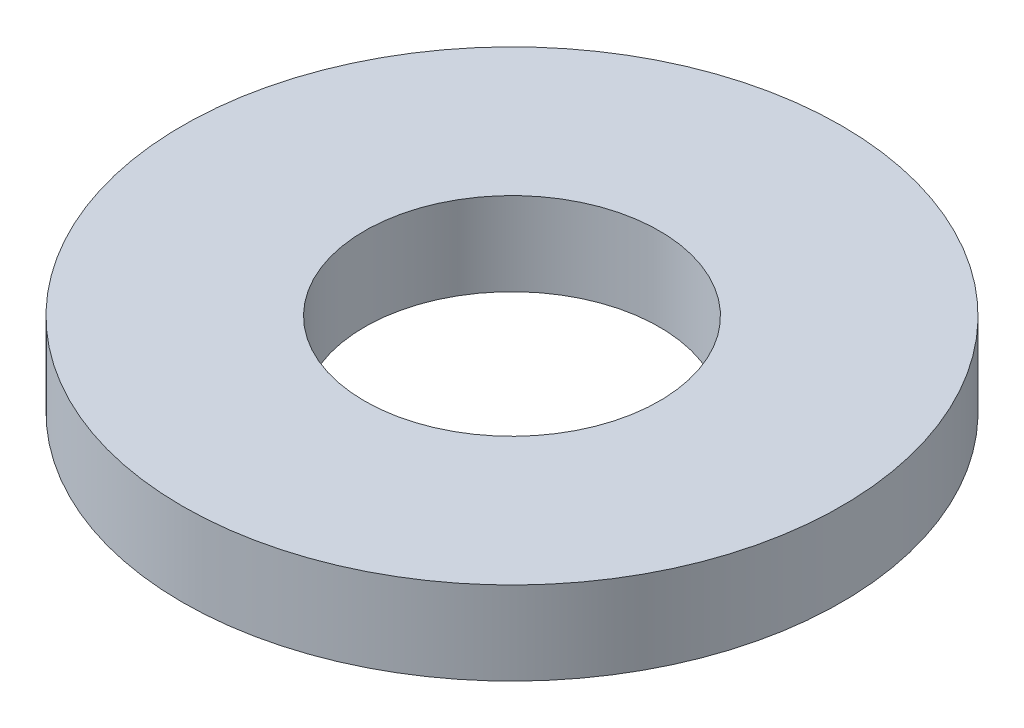
ISO-10303-21;
HEADER;
FILE_DESCRIPTION(('STEP AP214'),'2;1');
FILE_NAME('part.step','',(''),(''),'','','');
FILE_SCHEMA(('AUTOMOTIVE_DESIGN { 1 0 10303 214 1 1 1 1 }'));
ENDSEC;
DATA;
#1=APPLICATION_CONTEXT('core data for automotive mechanical design processes');
#2=APPLICATION_PROTOCOL_DEFINITION('international standard','automotive_design',2000,#1);
#3=PRODUCT_CONTEXT('',#1,'mechanical');
#4=PRODUCT('Part','Part','',(#3));
#5=PRODUCT_RELATED_PRODUCT_CATEGORY('part','',(#4));
#6=PRODUCT_DEFINITION_FORMATION('','',#4);
#7=PRODUCT_DEFINITION_CONTEXT('part definition',#1,'design');
#8=PRODUCT_DEFINITION('design','',#6,#7);
#9=PRODUCT_DEFINITION_SHAPE('','',#8);
#10=(LENGTH_UNIT() NAMED_UNIT(*) SI_UNIT(.MILLI.,.METRE.));
#11=(NAMED_UNIT(*) PLANE_ANGLE_UNIT() SI_UNIT($,.RADIAN.));
#12=(NAMED_UNIT(*) SI_UNIT($,.STERADIAN.) SOLID_ANGLE_UNIT());
#13=UNCERTAINTY_MEASURE_WITH_UNIT(LENGTH_MEASURE(1.E-05),#10,'distance_accuracy_value','');
#14=(GEOMETRIC_REPRESENTATION_CONTEXT(3) GLOBAL_UNCERTAINTY_ASSIGNED_CONTEXT((#13)) GLOBAL_UNIT_ASSIGNED_CONTEXT((#10,
#11,#12)) REPRESENTATION_CONTEXT('',''));
#15=CARTESIAN_POINT('',(0.,0.,0.));
#16=DIRECTION('',(0.,0.,1.));
#17=DIRECTION('',(1.,0.,0.));
#18=AXIS2_PLACEMENT_3D('',#15,#16,#17);
#19=CARTESIAN_POINT('',(0.,24.,0.));
#20=DIRECTION('',(0.,-1.,0.));
#21=DIRECTION('',(0.,0.,-1.));
#22=AXIS2_PLACEMENT_3D('',#19,#20,#21);
#23=CYLINDRICAL_SURFACE('',#22,95.);
#24=CARTESIAN_POINT('',(0.,24.,0.));
#25=DIRECTION('',(0.,1.,0.));
#26=DIRECTION('',(0.,0.,1.));
#27=AXIS2_PLACEMENT_3D('',#24,#25,#26);
#28=CIRCLE('',#27,95.);
#29=CARTESIAN_POINT('',(0.,24.,95.));
#30=VERTEX_POINT('',#29);
#31=EDGE_CURVE('E10',#30,#30,#28,.T.);
#32=ORIENTED_EDGE('',*,*,#31,.F.);
#33=EDGE_LOOP('',(#32));
#34=FACE_BOUND('',#33,.T.);
#35=CARTESIAN_POINT('',(0.,0.,0.));
#36=DIRECTION('',(0.,1.,0.));
#37=DIRECTION('',(0.,0.,1.));
#38=AXIS2_PLACEMENT_3D('',#35,#36,#37);
#39=CIRCLE('',#38,95.);
#40=CARTESIAN_POINT('',(0.,0.,95.));
#41=VERTEX_POINT('',#40);
#42=EDGE_CURVE('E37',#41,#41,#39,.T.);
#43=ORIENTED_EDGE('',*,*,#42,.T.);
#44=EDGE_LOOP('',(#43));
#45=FACE_BOUND('',#44,.T.);
#46=ADVANCED_FACE('F40',(#34,#45),#23,.T.);
#47=CARTESIAN_POINT('',(0.,24.,0.));
#48=DIRECTION('',(0.,1.,0.));
#49=DIRECTION('',(0.,0.,1.));
#50=AXIS2_PLACEMENT_3D('',#47,#48,#49);
#51=PLANE('',#50);
#52=CARTESIAN_POINT('',(0.,24.,0.));
#53=DIRECTION('',(0.,1.,0.));
#54=DIRECTION('',(0.,0.,1.));
#55=AXIS2_PLACEMENT_3D('',#52,#53,#54);
#56=CIRCLE('',#55,42.5);
#57=CARTESIAN_POINT('',(0.,24.,42.5));
#58=VERTEX_POINT('',#57);
#59=EDGE_CURVE('E50',#58,#58,#56,.T.);
#60=ORIENTED_EDGE('',*,*,#59,.F.);
#61=EDGE_LOOP('',(#60));
#62=FACE_BOUND('',#61,.T.);
#63=ORIENTED_EDGE('',*,*,#31,.T.);
#64=EDGE_LOOP('',(#63));
#65=FACE_BOUND('',#64,.T.);
#66=ADVANCED_FACE('F59',(#62,#65),#51,.T.);
#67=CARTESIAN_POINT('',(0.,0.,0.));
#68=DIRECTION('',(0.,1.,0.));
#69=DIRECTION('',(0.,0.,1.));
#70=AXIS2_PLACEMENT_3D('',#67,#68,#69);
#71=PLANE('',#70);
#72=CARTESIAN_POINT('',(0.,0.,0.));
#73=DIRECTION('',(0.,1.,0.));
#74=DIRECTION('',(0.,0.,1.));
#75=AXIS2_PLACEMENT_3D('',#72,#73,#74);
#76=CIRCLE('',#75,42.5);
#77=CARTESIAN_POINT('',(0.,0.,42.5));
#78=VERTEX_POINT('',#77);
#79=EDGE_CURVE('E47',#78,#78,#76,.T.);
#80=ORIENTED_EDGE('',*,*,#79,.T.);
#81=EDGE_LOOP('',(#80));
#82=FACE_BOUND('',#81,.T.);
#83=ORIENTED_EDGE('',*,*,#42,.F.);
#84=EDGE_LOOP('',(#83));
#85=FACE_BOUND('',#84,.T.);
#86=ADVANCED_FACE('F58',(#82,#85),#71,.F.);
#87=CARTESIAN_POINT('',(0.,24.,0.));
#88=DIRECTION('',(0.,-1.,0.));
#89=DIRECTION('',(0.,0.,-1.));
#90=AXIS2_PLACEMENT_3D('',#87,#88,#89);
#91=CYLINDRICAL_SURFACE('',#90,42.5);
#92=ORIENTED_EDGE('',*,*,#59,.T.);
#93=EDGE_LOOP('',(#92));
#94=FACE_BOUND('',#93,.T.);
#95=ORIENTED_EDGE('',*,*,#79,.F.);
#96=EDGE_LOOP('',(#95));
#97=FACE_BOUND('',#96,.T.);
#98=ADVANCED_FACE('F54',(#94,#97),#91,.F.);
#99=CLOSED_SHELL('',(#46,#66,#86,#98));
#100=MANIFOLD_SOLID_BREP('B2',#99);
#101=ADVANCED_BREP_SHAPE_REPRESENTATION('',(#18,#100),#14);
#102=SHAPE_DEFINITION_REPRESENTATION(#9,#101);
ENDSEC;
END-ISO-10303-21;
